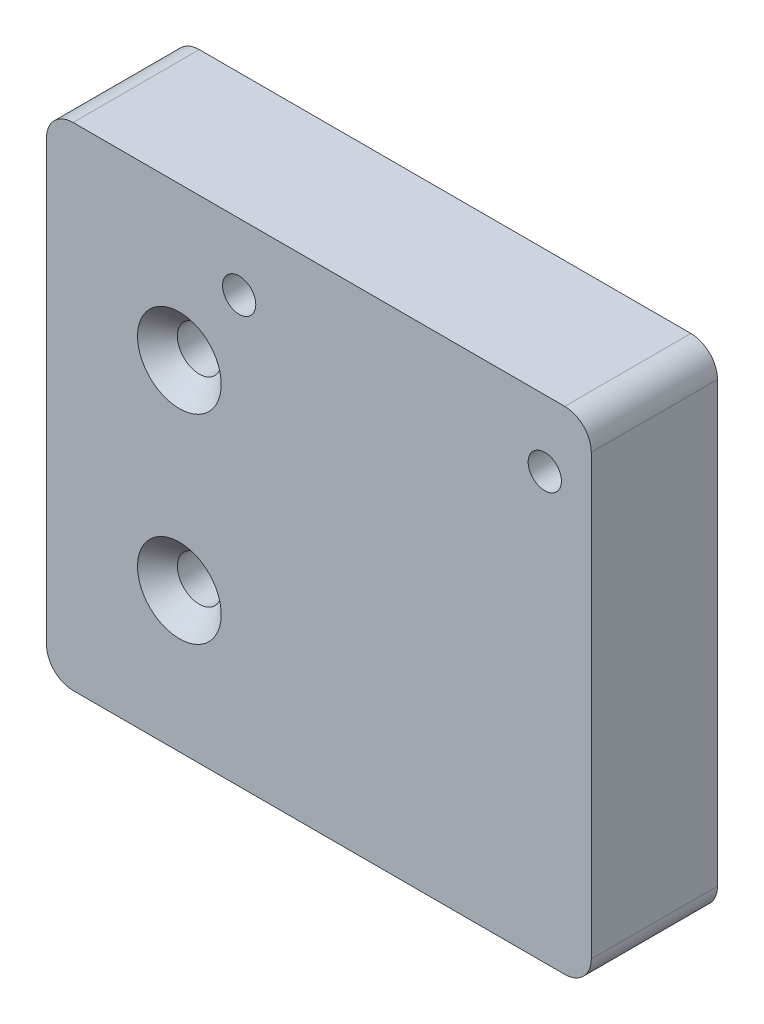
ISO-10303-21;
HEADER;
FILE_DESCRIPTION(('STEP AP214'),'2;1');
FILE_NAME('part.step','',(''),(''),'','','');
FILE_SCHEMA(('AUTOMOTIVE_DESIGN { 1 0 10303 214 1 1 1 1 }'));
ENDSEC;
DATA;
#1=APPLICATION_CONTEXT('core data for automotive mechanical design processes');
#2=APPLICATION_PROTOCOL_DEFINITION('international standard','automotive_design',2000,#1);
#3=PRODUCT_CONTEXT('',#1,'mechanical');
#4=PRODUCT('Part','Part','',(#3));
#5=PRODUCT_RELATED_PRODUCT_CATEGORY('part','',(#4));
#6=PRODUCT_DEFINITION_FORMATION('','',#4);
#7=PRODUCT_DEFINITION_CONTEXT('part definition',#1,'design');
#8=PRODUCT_DEFINITION('design','',#6,#7);
#9=PRODUCT_DEFINITION_SHAPE('','',#8);
#10=(LENGTH_UNIT() NAMED_UNIT(*) SI_UNIT(.MILLI.,.METRE.));
#11=(NAMED_UNIT(*) PLANE_ANGLE_UNIT() SI_UNIT($,.RADIAN.));
#12=(NAMED_UNIT(*) SI_UNIT($,.STERADIAN.) SOLID_ANGLE_UNIT());
#13=UNCERTAINTY_MEASURE_WITH_UNIT(LENGTH_MEASURE(1.E-05),#10,'distance_accuracy_value','');
#14=(GEOMETRIC_REPRESENTATION_CONTEXT(3) GLOBAL_UNCERTAINTY_ASSIGNED_CONTEXT((#13)) GLOBAL_UNIT_ASSIGNED_CONTEXT((#10,
#11,#12)) REPRESENTATION_CONTEXT('',''));
#15=CARTESIAN_POINT('',(0.,0.,0.));
#16=DIRECTION('',(0.,0.,1.));
#17=DIRECTION('',(1.,0.,0.));
#18=AXIS2_PLACEMENT_3D('',#15,#16,#17);
#19=CARTESIAN_POINT('',(61.9999999981127,72.839007865125,19.));
#20=DIRECTION('',(-1.,0.,0.));
#21=DIRECTION('',(0.,0.,1.));
#22=AXIS2_PLACEMENT_3D('',#19,#20,#21);
#23=PLANE('',#22);
#24=DIRECTION('',(0.,1.,0.));
#25=VECTOR('',#24,1.);
#26=CARTESIAN_POINT('',(61.9999999981127,72.839007865125,0.));
#27=LINE('',#26,#25);
#28=CARTESIAN_POINT('',(61.9999999981127,2.78900786512638,0.));
#29=VERTEX_POINT('',#28);
#30=CARTESIAN_POINT('',(61.9999999981127,68.839007865125,0.));
#31=VERTEX_POINT('',#30);
#32=EDGE_CURVE('E150',#29,#31,#27,.T.);
#33=ORIENTED_EDGE('',*,*,#32,.T.);
#34=DIRECTION('',(0.,0.,-1.));
#35=VECTOR('',#34,1.);
#36=CARTESIAN_POINT('',(61.9999999981127,68.839007865125,19.));
#37=LINE('',#36,#35);
#38=CARTESIAN_POINT('',(61.9999999981127,68.839007865125,19.));
#39=VERTEX_POINT('',#38);
#40=EDGE_CURVE('E182',#31,#39,#37,.F.);
#41=ORIENTED_EDGE('',*,*,#40,.T.);
#42=DIRECTION('',(0.,1.,0.));
#43=VECTOR('',#42,1.);
#44=CARTESIAN_POINT('',(61.9999999981127,72.839007865125,19.));
#45=LINE('',#44,#43);
#46=CARTESIAN_POINT('',(61.9999999981127,2.78900786512638,19.));
#47=VERTEX_POINT('',#46);
#48=EDGE_CURVE('E151',#47,#39,#45,.T.);
#49=ORIENTED_EDGE('',*,*,#48,.F.);
#50=DIRECTION('',(0.,0.,1.));
#51=VECTOR('',#50,1.);
#52=CARTESIAN_POINT('',(61.9999999981127,2.78900786512638,0.));
#53=LINE('',#52,#51);
#54=EDGE_CURVE('E180',#47,#29,#53,.F.);
#55=ORIENTED_EDGE('',*,*,#54,.T.);
#56=EDGE_LOOP('',(#33,#41,#49,#55));
#57=FACE_BOUND('',#56,.T.);
#58=ADVANCED_FACE('F32',(#57),#23,.F.);
#59=CARTESIAN_POINT('',(61.9999999981127,72.839007865125,19.));
#60=DIRECTION('',(0.,-1.,0.));
#61=DIRECTION('',(1.,0.,0.));
#62=AXIS2_PLACEMENT_3D('',#59,#60,#61);
#63=PLANE('',#62);
#64=DIRECTION('',(-1.,0.,0.));
#65=VECTOR('',#64,1.);
#66=CARTESIAN_POINT('',(61.9999999981127,72.839007865125,19.));
#67=LINE('',#66,#65);
#68=CARTESIAN_POINT('',(57.9999999981127,72.839007865125,19.));
#69=VERTEX_POINT('',#68);
#70=CARTESIAN_POINT('',(-15.9999999999998,72.839007865125,19.));
#71=VERTEX_POINT('',#70);
#72=EDGE_CURVE('E154',#69,#71,#67,.T.);
#73=ORIENTED_EDGE('',*,*,#72,.F.);
#74=DIRECTION('',(0.,0.,-1.));
#75=VECTOR('',#74,1.);
#76=CARTESIAN_POINT('',(57.9999999981127,72.839007865125,19.));
#77=LINE('',#76,#75);
#78=CARTESIAN_POINT('',(57.9999999981127,72.839007865125,0.));
#79=VERTEX_POINT('',#78);
#80=EDGE_CURVE('E169',#69,#79,#77,.T.);
#81=ORIENTED_EDGE('',*,*,#80,.T.);
#82=DIRECTION('',(-1.,0.,0.));
#83=VECTOR('',#82,1.);
#84=CARTESIAN_POINT('',(61.9999999981127,72.839007865125,0.));
#85=LINE('',#84,#83);
#86=CARTESIAN_POINT('',(-15.9999999999998,72.839007865125,0.));
#87=VERTEX_POINT('',#86);
#88=EDGE_CURVE('E163',#79,#87,#85,.T.);
#89=ORIENTED_EDGE('',*,*,#88,.T.);
#90=DIRECTION('',(0.,0.,-1.));
#91=VECTOR('',#90,1.);
#92=CARTESIAN_POINT('',(-15.9999999999999,72.839007865125,19.));
#93=LINE('',#92,#91);
#94=EDGE_CURVE('E160',#87,#71,#93,.F.);
#95=ORIENTED_EDGE('',*,*,#94,.T.);
#96=EDGE_LOOP('',(#73,#81,#89,#95));
#97=FACE_BOUND('',#96,.T.);
#98=ADVANCED_FACE('F226',(#97),#63,.F.);
#99=CARTESIAN_POINT('',(-19.9999999999999,72.839007865125,19.));
#100=DIRECTION('',(1.,0.,0.));
#101=DIRECTION('',(0.,1.,0.));
#102=AXIS2_PLACEMENT_3D('',#99,#100,#101);
#103=PLANE('',#102);
#104=DIRECTION('',(0.,-1.,0.));
#105=VECTOR('',#104,1.);
#106=CARTESIAN_POINT('',(-19.9999999999999,72.839007865125,19.));
#107=LINE('',#106,#105);
#108=CARTESIAN_POINT('',(-19.9999999999999,68.839007865125,19.));
#109=VERTEX_POINT('',#108);
#110=CARTESIAN_POINT('',(-19.9999999999999,2.78900786512638,19.));
#111=VERTEX_POINT('',#110);
#112=EDGE_CURVE('E158',#109,#111,#107,.T.);
#113=ORIENTED_EDGE('',*,*,#112,.F.);
#114=DIRECTION('',(0.,0.,-1.));
#115=VECTOR('',#114,1.);
#116=CARTESIAN_POINT('',(-19.9999999999999,68.839007865125,19.));
#117=LINE('',#116,#115);
#118=CARTESIAN_POINT('',(-19.9999999999999,68.839007865125,0.));
#119=VERTEX_POINT('',#118);
#120=EDGE_CURVE('E11',#109,#119,#117,.T.);
#121=ORIENTED_EDGE('',*,*,#120,.T.);
#122=DIRECTION('',(0.,-1.,0.));
#123=VECTOR('',#122,1.);
#124=CARTESIAN_POINT('',(-19.9999999999999,72.839007865125,0.));
#125=LINE('',#124,#123);
#126=CARTESIAN_POINT('',(-19.9999999999999,2.78900786512638,0.));
#127=VERTEX_POINT('',#126);
#128=EDGE_CURVE('E155',#119,#127,#125,.T.);
#129=ORIENTED_EDGE('',*,*,#128,.T.);
#130=DIRECTION('',(0.,0.,1.));
#131=VECTOR('',#130,1.);
#132=CARTESIAN_POINT('',(-19.9999999999999,2.78900786512638,19.));
#133=LINE('',#132,#131);
#134=EDGE_CURVE('E40',#127,#111,#133,.T.);
#135=ORIENTED_EDGE('',*,*,#134,.T.);
#136=EDGE_LOOP('',(#113,#121,#129,#135));
#137=FACE_BOUND('',#136,.T.);
#138=ADVANCED_FACE('F197',(#137),#103,.F.);
#139=CARTESIAN_POINT('',(0.,0.,19.));
#140=DIRECTION('',(0.,0.,-1.));
#141=DIRECTION('',(-1.,0.,0.));
#142=AXIS2_PLACEMENT_3D('',#139,#140,#141);
#143=PLANE('',#142);
#144=CARTESIAN_POINT('',(0.,19.839007865125,19.));
#145=DIRECTION('',(0.,0.,1.));
#146=DIRECTION('',(1.,0.,0.));
#147=AXIS2_PLACEMENT_3D('',#144,#145,#146);
#148=CIRCLE('',#147,6.3);
#149=CARTESIAN_POINT('',(6.3,19.839007865125,19.));
#150=VERTEX_POINT('',#149);
#151=EDGE_CURVE('E120',#150,#150,#148,.T.);
#152=ORIENTED_EDGE('',*,*,#151,.F.);
#153=EDGE_LOOP('',(#152));
#154=FACE_BOUND('',#153,.T.);
#155=CARTESIAN_POINT('',(0.,49.839007865125,19.));
#156=DIRECTION('',(0.,0.,1.));
#157=DIRECTION('',(1.,0.,0.));
#158=AXIS2_PLACEMENT_3D('',#155,#156,#157);
#159=CIRCLE('',#158,6.3);
#160=CARTESIAN_POINT('',(6.3,49.839007865125,19.));
#161=VERTEX_POINT('',#160);
#162=EDGE_CURVE('E129',#161,#161,#159,.T.);
#163=ORIENTED_EDGE('',*,*,#162,.F.);
#164=EDGE_LOOP('',(#163));
#165=FACE_BOUND('',#164,.T.);
#166=CARTESIAN_POINT('',(8.99999999811863,62.839007865125,19.));
#167=DIRECTION('',(0.,0.,1.));
#168=DIRECTION('',(1.,0.,0.));
#169=AXIS2_PLACEMENT_3D('',#166,#167,#168);
#170=CIRCLE('',#169,2.5);
#171=CARTESIAN_POINT('',(11.4999999981186,62.839007865125,19.));
#172=VERTEX_POINT('',#171);
#173=EDGE_CURVE('E138',#172,#172,#170,.T.);
#174=ORIENTED_EDGE('',*,*,#173,.F.);
#175=EDGE_LOOP('',(#174));
#176=FACE_BOUND('',#175,.T.);
#177=CARTESIAN_POINT('',(54.9999999981186,62.8390078651251,19.));
#178=DIRECTION('',(0.,0.,1.));
#179=DIRECTION('',(1.,0.,0.));
#180=AXIS2_PLACEMENT_3D('',#177,#178,#179);
#181=CIRCLE('',#180,2.5);
#182=CARTESIAN_POINT('',(57.4999999981186,62.8390078651251,19.));
#183=VERTEX_POINT('',#182);
#184=EDGE_CURVE('E144',#183,#183,#181,.T.);
#185=ORIENTED_EDGE('',*,*,#184,.F.);
#186=EDGE_LOOP('',(#185));
#187=FACE_BOUND('',#186,.T.);
#188=ORIENTED_EDGE('',*,*,#48,.T.);
#189=CARTESIAN_POINT('',(57.9999999981127,68.839007865125,19.));
#190=DIRECTION('',(0.,0.,-1.));
#191=DIRECTION('',(-1.,0.,0.));
#192=AXIS2_PLACEMENT_3D('',#189,#190,#191);
#193=CIRCLE('',#192,4.);
#194=EDGE_CURVE('E188',#39,#69,#193,.F.);
#195=ORIENTED_EDGE('',*,*,#194,.T.);
#196=ORIENTED_EDGE('',*,*,#72,.T.);
#197=CARTESIAN_POINT('',(-15.9999999999999,68.839007865125,19.));
#198=DIRECTION('',(0.,0.,-1.));
#199=DIRECTION('',(-1.,0.,0.));
#200=AXIS2_PLACEMENT_3D('',#197,#198,#199);
#201=CIRCLE('',#200,4.);
#202=EDGE_CURVE('E185',#71,#109,#201,.F.);
#203=ORIENTED_EDGE('',*,*,#202,.T.);
#204=ORIENTED_EDGE('',*,*,#112,.T.);
#205=CARTESIAN_POINT('',(-15.9999999999999,2.78900786512638,19.));
#206=DIRECTION('',(0.,0.,-1.));
#207=DIRECTION('',(-1.,0.,0.));
#208=AXIS2_PLACEMENT_3D('',#205,#206,#207);
#209=CIRCLE('',#208,4.);
#210=CARTESIAN_POINT('',(-15.9999999999999,-1.21099213487362,19.));
#211=VERTEX_POINT('',#210);
#212=EDGE_CURVE('E55',#111,#211,#209,.F.);
#213=ORIENTED_EDGE('',*,*,#212,.T.);
#214=DIRECTION('',(1.,0.,0.));
#215=VECTOR('',#214,1.);
#216=CARTESIAN_POINT('',(61.9999999981127,-1.21099213487362,19.));
#217=LINE('',#216,#215);
#218=CARTESIAN_POINT('',(57.9999999981127,-1.21099213487362,19.));
#219=VERTEX_POINT('',#218);
#220=EDGE_CURVE('E110',#211,#219,#217,.T.);
#221=ORIENTED_EDGE('',*,*,#220,.T.);
#222=CARTESIAN_POINT('',(57.9999999981127,2.78900786512638,19.));
#223=DIRECTION('',(0.,0.,-1.));
#224=DIRECTION('',(-1.,0.,0.));
#225=AXIS2_PLACEMENT_3D('',#222,#223,#224);
#226=CIRCLE('',#225,4.);
#227=EDGE_CURVE('E47',#219,#47,#226,.F.);
#228=ORIENTED_EDGE('',*,*,#227,.T.);
#229=EDGE_LOOP('',(#188,#195,#196,#203,#204,#213,#221,#228));
#230=FACE_BOUND('',#229,.T.);
#231=ADVANCED_FACE('F202',(#154,#165,#176,#187,#230),#143,.F.);
#232=CARTESIAN_POINT('',(0.,0.,0.));
#233=DIRECTION('',(0.,0.,-1.));
#234=DIRECTION('',(-1.,0.,0.));
#235=AXIS2_PLACEMENT_3D('',#232,#233,#234);
#236=PLANE('',#235);
#237=ORIENTED_EDGE('',*,*,#88,.F.);
#238=CARTESIAN_POINT('',(57.9999999981127,68.839007865125,0.));
#239=DIRECTION('',(0.,0.,-1.));
#240=DIRECTION('',(-1.,0.,0.));
#241=AXIS2_PLACEMENT_3D('',#238,#239,#240);
#242=CIRCLE('',#241,4.);
#243=EDGE_CURVE('E178',#79,#31,#242,.T.);
#244=ORIENTED_EDGE('',*,*,#243,.T.);
#245=ORIENTED_EDGE('',*,*,#32,.F.);
#246=CARTESIAN_POINT('',(57.9999999981127,2.78900786512638,0.));
#247=DIRECTION('',(0.,0.,-1.));
#248=DIRECTION('',(-1.,0.,0.));
#249=AXIS2_PLACEMENT_3D('',#246,#247,#248);
#250=CIRCLE('',#249,4.);
#251=CARTESIAN_POINT('',(57.9999999981127,-1.21099213487362,0.));
#252=VERTEX_POINT('',#251);
#253=EDGE_CURVE('E176',#29,#252,#250,.T.);
#254=ORIENTED_EDGE('',*,*,#253,.T.);
#255=DIRECTION('',(1.,0.,0.));
#256=VECTOR('',#255,1.);
#257=CARTESIAN_POINT('',(61.9999999981127,-1.21099213487362,0.));
#258=LINE('',#257,#256);
#259=CARTESIAN_POINT('',(-15.9999999999999,-1.21099213487362,0.));
#260=VERTEX_POINT('',#259);
#261=EDGE_CURVE('E113',#260,#252,#258,.T.);
#262=ORIENTED_EDGE('',*,*,#261,.F.);
#263=CARTESIAN_POINT('',(-15.9999999999999,2.78900786512638,0.));
#264=DIRECTION('',(0.,0.,-1.));
#265=DIRECTION('',(-1.,0.,0.));
#266=AXIS2_PLACEMENT_3D('',#263,#264,#265);
#267=CIRCLE('',#266,4.);
#268=EDGE_CURVE('E172',#260,#127,#267,.T.);
#269=ORIENTED_EDGE('',*,*,#268,.T.);
#270=ORIENTED_EDGE('',*,*,#128,.F.);
#271=CARTESIAN_POINT('',(-15.9999999999999,68.839007865125,0.));
#272=DIRECTION('',(0.,0.,-1.));
#273=DIRECTION('',(-1.,0.,0.));
#274=AXIS2_PLACEMENT_3D('',#271,#272,#273);
#275=CIRCLE('',#274,4.);
#276=EDGE_CURVE('E174',#119,#87,#275,.T.);
#277=ORIENTED_EDGE('',*,*,#276,.T.);
#278=EDGE_LOOP('',(#237,#244,#245,#254,#262,#269,#270,#277));
#279=FACE_BOUND('',#278,.T.);
#280=CARTESIAN_POINT('',(0.,19.839007865125,0.));
#281=DIRECTION('',(0.,0.,1.));
#282=DIRECTION('',(1.,0.,0.));
#283=AXIS2_PLACEMENT_3D('',#280,#281,#282);
#284=CIRCLE('',#283,3.3);
#285=CARTESIAN_POINT('',(3.3,19.839007865125,0.));
#286=VERTEX_POINT('',#285);
#287=EDGE_CURVE('E126',#286,#286,#284,.T.);
#288=ORIENTED_EDGE('',*,*,#287,.T.);
#289=EDGE_LOOP('',(#288));
#290=FACE_BOUND('',#289,.T.);
#291=CARTESIAN_POINT('',(0.,49.839007865125,0.));
#292=DIRECTION('',(0.,0.,1.));
#293=DIRECTION('',(1.,0.,0.));
#294=AXIS2_PLACEMENT_3D('',#291,#292,#293);
#295=CIRCLE('',#294,3.3);
#296=CARTESIAN_POINT('',(3.3,49.839007865125,0.));
#297=VERTEX_POINT('',#296);
#298=EDGE_CURVE('E135',#297,#297,#295,.T.);
#299=ORIENTED_EDGE('',*,*,#298,.T.);
#300=EDGE_LOOP('',(#299));
#301=FACE_BOUND('',#300,.T.);
#302=CARTESIAN_POINT('',(8.99999999811863,62.839007865125,0.));
#303=DIRECTION('',(0.,0.,1.));
#304=DIRECTION('',(1.,0.,0.));
#305=AXIS2_PLACEMENT_3D('',#302,#303,#304);
#306=CIRCLE('',#305,2.5);
#307=CARTESIAN_POINT('',(11.4999999981186,62.839007865125,0.));
#308=VERTEX_POINT('',#307);
#309=EDGE_CURVE('E141',#308,#308,#306,.T.);
#310=ORIENTED_EDGE('',*,*,#309,.T.);
#311=EDGE_LOOP('',(#310));
#312=FACE_BOUND('',#311,.T.);
#313=CARTESIAN_POINT('',(54.9999999981186,62.8390078651251,0.));
#314=DIRECTION('',(0.,0.,1.));
#315=DIRECTION('',(1.,0.,0.));
#316=AXIS2_PLACEMENT_3D('',#313,#314,#315);
#317=CIRCLE('',#316,2.5);
#318=CARTESIAN_POINT('',(57.4999999981186,62.8390078651251,0.));
#319=VERTEX_POINT('',#318);
#320=EDGE_CURVE('E147',#319,#319,#317,.T.);
#321=ORIENTED_EDGE('',*,*,#320,.T.);
#322=EDGE_LOOP('',(#321));
#323=FACE_BOUND('',#322,.T.);
#324=ADVANCED_FACE('F210',(#279,#290,#301,#312,#323),#236,.T.);
#325=CARTESIAN_POINT('',(54.9999999981186,62.8390078651251,19.));
#326=DIRECTION('',(0.,0.,1.));
#327=DIRECTION('',(1.,0.,0.));
#328=AXIS2_PLACEMENT_3D('',#325,#326,#327);
#329=CYLINDRICAL_SURFACE('',#328,2.5);
#330=ORIENTED_EDGE('',*,*,#320,.F.);
#331=EDGE_LOOP('',(#330));
#332=FACE_BOUND('',#331,.T.);
#333=ORIENTED_EDGE('',*,*,#184,.T.);
#334=EDGE_LOOP('',(#333));
#335=FACE_BOUND('',#334,.T.);
#336=ADVANCED_FACE('F285',(#332,#335),#329,.F.);
#337=CARTESIAN_POINT('',(8.99999999811863,62.839007865125,19.));
#338=DIRECTION('',(0.,0.,1.));
#339=DIRECTION('',(1.,0.,0.));
#340=AXIS2_PLACEMENT_3D('',#337,#338,#339);
#341=CYLINDRICAL_SURFACE('',#340,2.5);
#342=ORIENTED_EDGE('',*,*,#309,.F.);
#343=EDGE_LOOP('',(#342));
#344=FACE_BOUND('',#343,.T.);
#345=ORIENTED_EDGE('',*,*,#173,.T.);
#346=EDGE_LOOP('',(#345));
#347=FACE_BOUND('',#346,.T.);
#348=ADVANCED_FACE('F363',(#344,#347),#341,.F.);
#349=CARTESIAN_POINT('',(0.,49.839007865125,19.));
#350=DIRECTION('',(0.,0.,1.));
#351=DIRECTION('',(1.,0.,0.));
#352=AXIS2_PLACEMENT_3D('',#349,#350,#351);
#353=CYLINDRICAL_SURFACE('',#352,3.3);
#354=ORIENTED_EDGE('',*,*,#298,.F.);
#355=EDGE_LOOP('',(#354));
#356=FACE_BOUND('',#355,.T.);
#357=CARTESIAN_POINT('',(0.,49.839007865125,16.));
#358=DIRECTION('',(0.,0.,1.));
#359=DIRECTION('',(1.,0.,0.));
#360=AXIS2_PLACEMENT_3D('',#357,#358,#359);
#361=CIRCLE('',#360,3.3);
#362=CARTESIAN_POINT('',(3.3,49.839007865125,16.));
#363=VERTEX_POINT('',#362);
#364=EDGE_CURVE('E132',#363,#363,#361,.T.);
#365=ORIENTED_EDGE('',*,*,#364,.T.);
#366=EDGE_LOOP('',(#365));
#367=FACE_BOUND('',#366,.T.);
#368=ADVANCED_FACE('F353',(#356,#367),#353,.F.);
#369=CARTESIAN_POINT('',(0.,49.839007865125,19.));
#370=DIRECTION('',(0.,0.,1.));
#371=DIRECTION('',(1.,0.,0.));
#372=AXIS2_PLACEMENT_3D('',#369,#370,#371);
#373=CONICAL_SURFACE('',#372,6.3,0.785398163397448);
#374=ORIENTED_EDGE('',*,*,#364,.F.);
#375=EDGE_LOOP('',(#374));
#376=FACE_BOUND('',#375,.T.);
#377=ORIENTED_EDGE('',*,*,#162,.T.);
#378=EDGE_LOOP('',(#377));
#379=FACE_BOUND('',#378,.T.);
#380=ADVANCED_FACE('F343',(#376,#379),#373,.F.);
#381=CARTESIAN_POINT('',(0.,19.839007865125,19.));
#382=DIRECTION('',(0.,0.,1.));
#383=DIRECTION('',(1.,0.,0.));
#384=AXIS2_PLACEMENT_3D('',#381,#382,#383);
#385=CYLINDRICAL_SURFACE('',#384,3.3);
#386=ORIENTED_EDGE('',*,*,#287,.F.);
#387=EDGE_LOOP('',(#386));
#388=FACE_BOUND('',#387,.T.);
#389=CARTESIAN_POINT('',(0.,19.839007865125,16.));
#390=DIRECTION('',(0.,0.,1.));
#391=DIRECTION('',(1.,0.,0.));
#392=AXIS2_PLACEMENT_3D('',#389,#390,#391);
#393=CIRCLE('',#392,3.3);
#394=CARTESIAN_POINT('',(3.3,19.839007865125,16.));
#395=VERTEX_POINT('',#394);
#396=EDGE_CURVE('E123',#395,#395,#393,.T.);
#397=ORIENTED_EDGE('',*,*,#396,.T.);
#398=EDGE_LOOP('',(#397));
#399=FACE_BOUND('',#398,.T.);
#400=ADVANCED_FACE('F333',(#388,#399),#385,.F.);
#401=CARTESIAN_POINT('',(0.,19.839007865125,19.));
#402=DIRECTION('',(0.,0.,1.));
#403=DIRECTION('',(1.,0.,0.));
#404=AXIS2_PLACEMENT_3D('',#401,#402,#403);
#405=CONICAL_SURFACE('',#404,6.3,0.785398163397448);
#406=ORIENTED_EDGE('',*,*,#396,.F.);
#407=EDGE_LOOP('',(#406));
#408=FACE_BOUND('',#407,.T.);
#409=ORIENTED_EDGE('',*,*,#151,.T.);
#410=EDGE_LOOP('',(#409));
#411=FACE_BOUND('',#410,.T.);
#412=ADVANCED_FACE('F273',(#408,#411),#405,.F.);
#413=CARTESIAN_POINT('',(61.9999999981127,-1.21099213487362,-83.1957062253057));
#414=DIRECTION('',(0.,-1.,0.));
#415=DIRECTION('',(0.,0.,-1.));
#416=AXIS2_PLACEMENT_3D('',#413,#414,#415);
#417=PLANE('',#416);
#418=CARTESIAN_POINT('',(41.9999999981138,-1.21099213487362,9.49999999999984));
#419=DIRECTION('',(0.,-1.,0.));
#420=DIRECTION('',(0.,0.,-1.));
#421=AXIS2_PLACEMENT_3D('',#418,#419,#420);
#422=CIRCLE('',#421,2.09999999999999);
#423=CARTESIAN_POINT('',(41.9999999981138,-1.21099213487362,7.39999999999985));
#424=VERTEX_POINT('',#423);
#425=EDGE_CURVE('E111',#424,#424,#422,.T.);
#426=ORIENTED_EDGE('',*,*,#425,.F.);
#427=EDGE_LOOP('',(#426));
#428=FACE_BOUND('',#427,.T.);
#429=ORIENTED_EDGE('',*,*,#261,.T.);
#430=DIRECTION('',(0.,0.,1.));
#431=VECTOR('',#430,1.);
#432=CARTESIAN_POINT('',(57.9999999981127,-1.21099213487362,19.));
#433=LINE('',#432,#431);
#434=EDGE_CURVE('E192',#252,#219,#433,.T.);
#435=ORIENTED_EDGE('',*,*,#434,.T.);
#436=ORIENTED_EDGE('',*,*,#220,.F.);
#437=DIRECTION('',(0.,0.,1.));
#438=VECTOR('',#437,1.);
#439=CARTESIAN_POINT('',(-15.9999999999999,-1.21099213487362,0.));
#440=LINE('',#439,#438);
#441=EDGE_CURVE('E190',#211,#260,#440,.F.);
#442=ORIENTED_EDGE('',*,*,#441,.T.);
#443=EDGE_LOOP('',(#429,#435,#436,#442));
#444=FACE_BOUND('',#443,.T.);
#445=ADVANCED_FACE('F104',(#428,#444),#417,.T.);
#446=CARTESIAN_POINT('',(41.9999999981138,28.7890078651264,9.49999999999984));
#447=DIRECTION('',(0.,-1.,0.));
#448=DIRECTION('',(0.,0.,-1.));
#449=AXIS2_PLACEMENT_3D('',#446,#447,#448);
#450=CONICAL_SURFACE('',#449,2.09999999999999,1.02974425867665);
#451=CARTESIAN_POINT('',(41.9999999981138,30.0508151650843,9.49999999999984));
#452=VERTEX_POINT('',#451);
#453=VERTEX_LOOP('',#452);
#454=FACE_BOUND('',#453,.T.);
#455=CARTESIAN_POINT('',(41.9999999981138,28.7890078651264,9.49999999999984));
#456=DIRECTION('',(0.,-1.,0.));
#457=DIRECTION('',(0.,0.,-1.));
#458=AXIS2_PLACEMENT_3D('',#455,#456,#457);
#459=CIRCLE('',#458,2.09999999999999);
#460=CARTESIAN_POINT('',(41.9999999981138,28.7890078651264,7.39999999999985));
#461=VERTEX_POINT('',#460);
#462=EDGE_CURVE('E108',#461,#461,#459,.T.);
#463=ORIENTED_EDGE('',*,*,#462,.T.);
#464=EDGE_LOOP('',(#463));
#465=FACE_BOUND('',#464,.T.);
#466=ADVANCED_FACE('F100',(#454,#465),#450,.F.);
#467=CARTESIAN_POINT('',(41.9999999981138,-1.21099213487362,9.49999999999984));
#468=DIRECTION('',(0.,-1.,0.));
#469=DIRECTION('',(0.,0.,-1.));
#470=AXIS2_PLACEMENT_3D('',#467,#468,#469);
#471=CYLINDRICAL_SURFACE('',#470,2.09999999999999);
#472=ORIENTED_EDGE('',*,*,#462,.F.);
#473=EDGE_LOOP('',(#472));
#474=FACE_BOUND('',#473,.T.);
#475=ORIENTED_EDGE('',*,*,#425,.T.);
#476=EDGE_LOOP('',(#475));
#477=FACE_BOUND('',#476,.T.);
#478=ADVANCED_FACE('F103',(#474,#477),#471,.F.);
#479=CARTESIAN_POINT('',(57.9999999981127,68.839007865125,19.));
#480=DIRECTION('',(0.,0.,-1.));
#481=DIRECTION('',(-1.,0.,0.));
#482=AXIS2_PLACEMENT_3D('',#479,#480,#481);
#483=CYLINDRICAL_SURFACE('',#482,4.);
#484=ORIENTED_EDGE('',*,*,#194,.F.);
#485=ORIENTED_EDGE('',*,*,#40,.F.);
#486=ORIENTED_EDGE('',*,*,#243,.F.);
#487=ORIENTED_EDGE('',*,*,#80,.F.);
#488=EDGE_LOOP('',(#484,#485,#486,#487));
#489=FACE_BOUND('',#488,.T.);
#490=ADVANCED_FACE('F223',(#489),#483,.T.);
#491=CARTESIAN_POINT('',(57.9999999981127,2.78900786512638,-83.1957062253057));
#492=DIRECTION('',(0.,0.,-1.));
#493=DIRECTION('',(-1.,0.,0.));
#494=AXIS2_PLACEMENT_3D('',#491,#492,#493);
#495=CYLINDRICAL_SURFACE('',#494,4.);
#496=ORIENTED_EDGE('',*,*,#253,.F.);
#497=ORIENTED_EDGE('',*,*,#54,.F.);
#498=ORIENTED_EDGE('',*,*,#227,.F.);
#499=ORIENTED_EDGE('',*,*,#434,.F.);
#500=EDGE_LOOP('',(#496,#497,#498,#499));
#501=FACE_BOUND('',#500,.T.);
#502=ADVANCED_FACE('F221',(#501),#495,.T.);
#503=CARTESIAN_POINT('',(-15.9999999999999,68.839007865125,19.));
#504=DIRECTION('',(0.,0.,-1.));
#505=DIRECTION('',(-1.,0.,0.));
#506=AXIS2_PLACEMENT_3D('',#503,#504,#505);
#507=CYLINDRICAL_SURFACE('',#506,4.);
#508=ORIENTED_EDGE('',*,*,#202,.F.);
#509=ORIENTED_EDGE('',*,*,#94,.F.);
#510=ORIENTED_EDGE('',*,*,#276,.F.);
#511=ORIENTED_EDGE('',*,*,#120,.F.);
#512=EDGE_LOOP('',(#508,#509,#510,#511));
#513=FACE_BOUND('',#512,.T.);
#514=ADVANCED_FACE('F207',(#513),#507,.T.);
#515=CARTESIAN_POINT('',(-15.9999999999999,2.78900786512638,19.));
#516=DIRECTION('',(0.,0.,-1.));
#517=DIRECTION('',(-1.,0.,0.));
#518=AXIS2_PLACEMENT_3D('',#515,#516,#517);
#519=CYLINDRICAL_SURFACE('',#518,4.);
#520=ORIENTED_EDGE('',*,*,#268,.F.);
#521=ORIENTED_EDGE('',*,*,#441,.F.);
#522=ORIENTED_EDGE('',*,*,#212,.F.);
#523=ORIENTED_EDGE('',*,*,#134,.F.);
#524=EDGE_LOOP('',(#520,#521,#522,#523));
#525=FACE_BOUND('',#524,.T.);
#526=ADVANCED_FACE('F34',(#525),#519,.T.);
#527=CLOSED_SHELL('',(#58,#98,#138,#231,#324,#336,#348,#368,#380,#400,#412,#445,#466,#478,#490,
#502,#514,#526));
#528=MANIFOLD_SOLID_BREP('B2',#527);
#529=ADVANCED_BREP_SHAPE_REPRESENTATION('',(#18,#528),#14);
#530=SHAPE_DEFINITION_REPRESENTATION(#9,#529);
ENDSEC;
END-ISO-10303-21;
